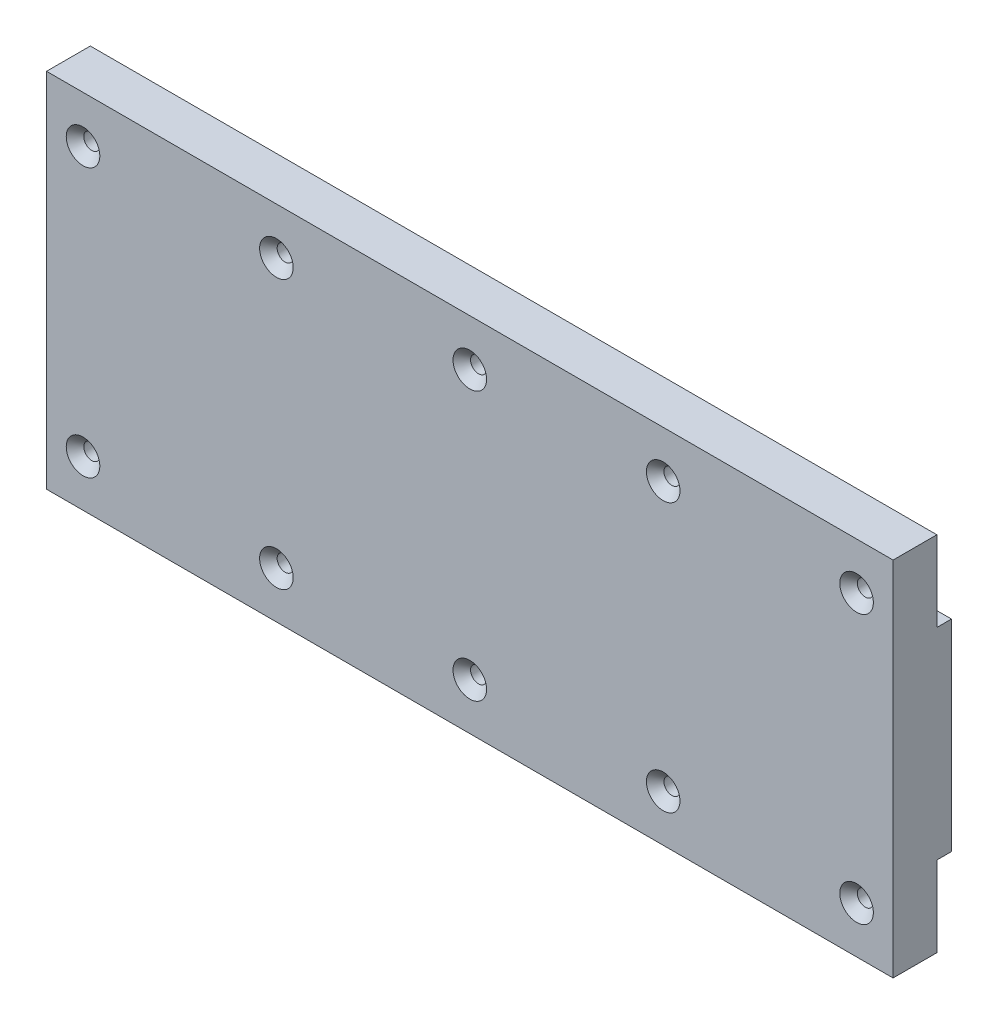
ISO-10303-21;
HEADER;
FILE_DESCRIPTION(('STEP AP214'),'2;1');
FILE_NAME('part.step','',(''),(''),'','','');
FILE_SCHEMA(('AUTOMOTIVE_DESIGN { 1 0 10303 214 1 1 1 1 }'));
ENDSEC;
DATA;
#1=APPLICATION_CONTEXT('core data for automotive mechanical design processes');
#2=APPLICATION_PROTOCOL_DEFINITION('international standard','automotive_design',2000,#1);
#3=PRODUCT_CONTEXT('',#1,'mechanical');
#4=PRODUCT('Part','Part','',(#3));
#5=PRODUCT_RELATED_PRODUCT_CATEGORY('part','',(#4));
#6=PRODUCT_DEFINITION_FORMATION('','',#4);
#7=PRODUCT_DEFINITION_CONTEXT('part definition',#1,'design');
#8=PRODUCT_DEFINITION('design','',#6,#7);
#9=PRODUCT_DEFINITION_SHAPE('','',#8);
#10=(LENGTH_UNIT() NAMED_UNIT(*) SI_UNIT(.MILLI.,.METRE.));
#11=(NAMED_UNIT(*) PLANE_ANGLE_UNIT() SI_UNIT($,.RADIAN.));
#12=(NAMED_UNIT(*) SI_UNIT($,.STERADIAN.) SOLID_ANGLE_UNIT());
#13=UNCERTAINTY_MEASURE_WITH_UNIT(LENGTH_MEASURE(1.E-05),#10,'distance_accuracy_value','');
#14=(GEOMETRIC_REPRESENTATION_CONTEXT(3) GLOBAL_UNCERTAINTY_ASSIGNED_CONTEXT((#13)) GLOBAL_UNIT_ASSIGNED_CONTEXT((#10,
#11,#12)) REPRESENTATION_CONTEXT('',''));
#15=CARTESIAN_POINT('',(0.,0.,0.));
#16=DIRECTION('',(0.,0.,1.));
#17=DIRECTION('',(1.,0.,0.));
#18=AXIS2_PLACEMENT_3D('',#15,#16,#17);
#19=CARTESIAN_POINT('',(580.,0.,0.));
#20=DIRECTION('',(0.,1.,0.));
#21=DIRECTION('',(0.,0.,1.));
#22=AXIS2_PLACEMENT_3D('',#19,#20,#21);
#23=PLANE('',#22);
#24=DIRECTION('',(0.,0.,-1.));
#25=VECTOR('',#24,1.);
#26=CARTESIAN_POINT('',(0.,0.,0.));
#27=LINE('',#26,#25);
#28=CARTESIAN_POINT('',(0.,0.,0.));
#29=VERTEX_POINT('',#28);
#30=CARTESIAN_POINT('',(0.,0.,-30.));
#31=VERTEX_POINT('',#30);
#32=EDGE_CURVE('E147',#29,#31,#27,.T.);
#33=ORIENTED_EDGE('',*,*,#32,.T.);
#34=DIRECTION('',(-1.,0.,0.));
#35=VECTOR('',#34,1.);
#36=CARTESIAN_POINT('',(580.,0.,-30.));
#37=LINE('',#36,#35);
#38=CARTESIAN_POINT('',(580.,0.,-30.));
#39=VERTEX_POINT('',#38);
#40=EDGE_CURVE('E189',#39,#31,#37,.T.);
#41=ORIENTED_EDGE('',*,*,#40,.F.);
#42=DIRECTION('',(0.,0.,-1.));
#43=VECTOR('',#42,1.);
#44=CARTESIAN_POINT('',(580.,0.,0.));
#45=LINE('',#44,#43);
#46=CARTESIAN_POINT('',(580.,0.,0.));
#47=VERTEX_POINT('',#46);
#48=EDGE_CURVE('E170',#47,#39,#45,.T.);
#49=ORIENTED_EDGE('',*,*,#48,.F.);
#50=DIRECTION('',(-1.,0.,0.));
#51=VECTOR('',#50,1.);
#52=CARTESIAN_POINT('',(580.,0.,0.));
#53=LINE('',#52,#51);
#54=EDGE_CURVE('E143',#47,#29,#53,.T.);
#55=ORIENTED_EDGE('',*,*,#54,.T.);
#56=EDGE_LOOP('',(#33,#41,#49,#55));
#57=FACE_BOUND('',#56,.T.);
#58=ADVANCED_FACE('F43',(#57),#23,.F.);
#59=CARTESIAN_POINT('',(580.,0.,-30.));
#60=DIRECTION('',(0.,0.,1.));
#61=DIRECTION('',(1.,0.,0.));
#62=AXIS2_PLACEMENT_3D('',#59,#60,#61);
#63=PLANE('',#62);
#64=CARTESIAN_POINT('',(290.,32.,-30.));
#65=DIRECTION('',(0.,0.,1.));
#66=DIRECTION('',(1.,0.,0.));
#67=AXIS2_PLACEMENT_3D('',#64,#65,#66);
#68=CIRCLE('',#67,5.49999999999996);
#69=CARTESIAN_POINT('',(295.5,32.,-30.));
#70=VERTEX_POINT('',#69);
#71=EDGE_CURVE('E152',#70,#70,#68,.T.);
#72=ORIENTED_EDGE('',*,*,#71,.T.);
#73=EDGE_LOOP('',(#72));
#74=FACE_BOUND('',#73,.T.);
#75=CARTESIAN_POINT('',(422.5,32.,-30.));
#76=DIRECTION('',(0.,0.,1.));
#77=DIRECTION('',(1.,0.,0.));
#78=AXIS2_PLACEMENT_3D('',#75,#76,#77);
#79=CIRCLE('',#78,5.49999999999996);
#80=CARTESIAN_POINT('',(428.,32.,-30.));
#81=VERTEX_POINT('',#80);
#82=EDGE_CURVE('E383',#81,#81,#79,.T.);
#83=ORIENTED_EDGE('',*,*,#82,.T.);
#84=EDGE_LOOP('',(#83));
#85=FACE_BOUND('',#84,.T.);
#86=CARTESIAN_POINT('',(25.,32.,-30.));
#87=DIRECTION('',(0.,0.,1.));
#88=DIRECTION('',(1.,0.,0.));
#89=AXIS2_PLACEMENT_3D('',#86,#87,#88);
#90=CIRCLE('',#89,5.5);
#91=CARTESIAN_POINT('',(30.5,32.,-30.));
#92=VERTEX_POINT('',#91);
#93=EDGE_CURVE('E367',#92,#92,#90,.T.);
#94=ORIENTED_EDGE('',*,*,#93,.T.);
#95=EDGE_LOOP('',(#94));
#96=FACE_BOUND('',#95,.T.);
#97=CARTESIAN_POINT('',(157.5,32.,-30.));
#98=DIRECTION('',(0.,0.,1.));
#99=DIRECTION('',(1.,0.,0.));
#100=AXIS2_PLACEMENT_3D('',#97,#98,#99);
#101=CIRCLE('',#100,5.49999999999999);
#102=CARTESIAN_POINT('',(163.,32.,-30.));
#103=VERTEX_POINT('',#102);
#104=EDGE_CURVE('E368',#103,#103,#101,.T.);
#105=ORIENTED_EDGE('',*,*,#104,.T.);
#106=EDGE_LOOP('',(#105));
#107=FACE_BOUND('',#106,.T.);
#108=CARTESIAN_POINT('',(555.,32.,-30.));
#109=DIRECTION('',(0.,0.,1.));
#110=DIRECTION('',(1.,0.,0.));
#111=AXIS2_PLACEMENT_3D('',#108,#109,#110);
#112=CIRCLE('',#111,5.49999999999996);
#113=CARTESIAN_POINT('',(560.5,32.,-30.));
#114=VERTEX_POINT('',#113);
#115=EDGE_CURVE('E655',#114,#114,#112,.T.);
#116=ORIENTED_EDGE('',*,*,#115,.T.);
#117=EDGE_LOOP('',(#116));
#118=FACE_BOUND('',#117,.T.);
#119=DIRECTION('',(0.,1.,0.));
#120=VECTOR('',#119,1.);
#121=CARTESIAN_POINT('',(0.,0.,-30.));
#122=LINE('',#121,#120);
#123=CARTESIAN_POINT('',(0.,55.,-30.));
#124=VERTEX_POINT('',#123);
#125=EDGE_CURVE('E151',#31,#124,#122,.T.);
#126=ORIENTED_EDGE('',*,*,#125,.T.);
#127=DIRECTION('',(-1.,0.,0.));
#128=VECTOR('',#127,1.);
#129=CARTESIAN_POINT('',(580.,55.,-30.));
#130=LINE('',#129,#128);
#131=CARTESIAN_POINT('',(580.,55.,-30.));
#132=VERTEX_POINT('',#131);
#133=EDGE_CURVE('E185',#132,#124,#130,.T.);
#134=ORIENTED_EDGE('',*,*,#133,.F.);
#135=DIRECTION('',(0.,1.,0.));
#136=VECTOR('',#135,1.);
#137=CARTESIAN_POINT('',(580.,0.,-30.));
#138=LINE('',#137,#136);
#139=EDGE_CURVE('E106',#39,#132,#138,.T.);
#140=ORIENTED_EDGE('',*,*,#139,.F.);
#141=ORIENTED_EDGE('',*,*,#40,.T.);
#142=EDGE_LOOP('',(#126,#134,#140,#141));
#143=FACE_BOUND('',#142,.T.);
#144=ADVANCED_FACE('F285',(#74,#85,#96,#107,#118,#143),#63,.F.);
#145=CARTESIAN_POINT('',(580.,55.,-30.));
#146=DIRECTION('',(0.,1.,0.));
#147=DIRECTION('',(0.,0.,1.));
#148=AXIS2_PLACEMENT_3D('',#145,#146,#147);
#149=PLANE('',#148);
#150=DIRECTION('',(0.,0.,-1.));
#151=VECTOR('',#150,1.);
#152=CARTESIAN_POINT('',(0.,55.,-30.));
#153=LINE('',#152,#151);
#154=CARTESIAN_POINT('',(0.,55.,-40.));
#155=VERTEX_POINT('',#154);
#156=EDGE_CURVE('E155',#124,#155,#153,.T.);
#157=ORIENTED_EDGE('',*,*,#156,.T.);
#158=DIRECTION('',(-1.,0.,0.));
#159=VECTOR('',#158,1.);
#160=CARTESIAN_POINT('',(580.,55.,-40.));
#161=LINE('',#160,#159);
#162=CARTESIAN_POINT('',(580.,55.,-40.));
#163=VERTEX_POINT('',#162);
#164=EDGE_CURVE('E181',#163,#155,#161,.T.);
#165=ORIENTED_EDGE('',*,*,#164,.F.);
#166=DIRECTION('',(0.,0.,-1.));
#167=VECTOR('',#166,1.);
#168=CARTESIAN_POINT('',(580.,55.,-30.));
#169=LINE('',#168,#167);
#170=EDGE_CURVE('E398',#132,#163,#169,.T.);
#171=ORIENTED_EDGE('',*,*,#170,.F.);
#172=ORIENTED_EDGE('',*,*,#133,.T.);
#173=EDGE_LOOP('',(#157,#165,#171,#172));
#174=FACE_BOUND('',#173,.T.);
#175=ADVANCED_FACE('F291',(#174),#149,.F.);
#176=CARTESIAN_POINT('',(580.,193.,-40.));
#177=DIRECTION('',(0.,0.,1.));
#178=DIRECTION('',(0.,-1.,0.));
#179=AXIS2_PLACEMENT_3D('',#176,#177,#178);
#180=PLANE('',#179);
#181=DIRECTION('',(0.,1.,0.));
#182=VECTOR('',#181,1.);
#183=CARTESIAN_POINT('',(0.,193.,-40.));
#184=LINE('',#183,#182);
#185=CARTESIAN_POINT('',(0.,193.,-40.));
#186=VERTEX_POINT('',#185);
#187=EDGE_CURVE('E158',#155,#186,#184,.T.);
#188=ORIENTED_EDGE('',*,*,#187,.T.);
#189=DIRECTION('',(-1.,0.,0.));
#190=VECTOR('',#189,1.);
#191=CARTESIAN_POINT('',(580.,193.,-40.));
#192=LINE('',#191,#190);
#193=CARTESIAN_POINT('',(580.,193.,-40.));
#194=VERTEX_POINT('',#193);
#195=EDGE_CURVE('E177',#194,#186,#192,.T.);
#196=ORIENTED_EDGE('',*,*,#195,.F.);
#197=DIRECTION('',(0.,1.,0.));
#198=VECTOR('',#197,1.);
#199=CARTESIAN_POINT('',(580.,193.,-40.));
#200=LINE('',#199,#198);
#201=EDGE_CURVE('E401',#163,#194,#200,.T.);
#202=ORIENTED_EDGE('',*,*,#201,.F.);
#203=ORIENTED_EDGE('',*,*,#164,.T.);
#204=EDGE_LOOP('',(#188,#196,#202,#203));
#205=FACE_BOUND('',#204,.T.);
#206=ADVANCED_FACE('F409',(#205),#180,.F.);
#207=CARTESIAN_POINT('',(580.,193.,-30.));
#208=DIRECTION('',(0.,-1.,0.));
#209=DIRECTION('',(0.,0.,-1.));
#210=AXIS2_PLACEMENT_3D('',#207,#208,#209);
#211=PLANE('',#210);
#212=DIRECTION('',(0.,0.,1.));
#213=VECTOR('',#212,1.);
#214=CARTESIAN_POINT('',(0.,193.,-30.));
#215=LINE('',#214,#213);
#216=CARTESIAN_POINT('',(0.,193.,-30.));
#217=VERTEX_POINT('',#216);
#218=EDGE_CURVE('E161',#186,#217,#215,.T.);
#219=ORIENTED_EDGE('',*,*,#218,.T.);
#220=DIRECTION('',(-1.,0.,0.));
#221=VECTOR('',#220,1.);
#222=CARTESIAN_POINT('',(580.,193.,-30.));
#223=LINE('',#222,#221);
#224=CARTESIAN_POINT('',(580.,193.,-30.));
#225=VERTEX_POINT('',#224);
#226=EDGE_CURVE('E136',#225,#217,#223,.T.);
#227=ORIENTED_EDGE('',*,*,#226,.F.);
#228=DIRECTION('',(0.,0.,1.));
#229=VECTOR('',#228,1.);
#230=CARTESIAN_POINT('',(580.,193.,-30.));
#231=LINE('',#230,#229);
#232=EDGE_CURVE('E125',#194,#225,#231,.T.);
#233=ORIENTED_EDGE('',*,*,#232,.F.);
#234=ORIENTED_EDGE('',*,*,#195,.T.);
#235=EDGE_LOOP('',(#219,#227,#233,#234));
#236=FACE_BOUND('',#235,.T.);
#237=ADVANCED_FACE('F413',(#236),#211,.F.);
#238=CARTESIAN_POINT('',(580.,248.,-30.));
#239=DIRECTION('',(0.,0.,1.));
#240=DIRECTION('',(1.,0.,0.));
#241=AXIS2_PLACEMENT_3D('',#238,#239,#240);
#242=PLANE('',#241);
#243=CARTESIAN_POINT('',(422.5,216.,-30.));
#244=DIRECTION('',(0.,0.,1.));
#245=DIRECTION('',(1.,0.,0.));
#246=AXIS2_PLACEMENT_3D('',#243,#244,#245);
#247=CIRCLE('',#246,5.50000000000002);
#248=CARTESIAN_POINT('',(428.,216.,-30.));
#249=VERTEX_POINT('',#248);
#250=EDGE_CURVE('E387',#249,#249,#247,.T.);
#251=ORIENTED_EDGE('',*,*,#250,.T.);
#252=EDGE_LOOP('',(#251));
#253=FACE_BOUND('',#252,.T.);
#254=CARTESIAN_POINT('',(555.,216.,-30.));
#255=DIRECTION('',(0.,0.,1.));
#256=DIRECTION('',(1.,0.,0.));
#257=AXIS2_PLACEMENT_3D('',#254,#255,#256);
#258=CIRCLE('',#257,5.49999999999996);
#259=CARTESIAN_POINT('',(560.5,216.,-30.));
#260=VERTEX_POINT('',#259);
#261=EDGE_CURVE('E373',#260,#260,#258,.T.);
#262=ORIENTED_EDGE('',*,*,#261,.T.);
#263=EDGE_LOOP('',(#262));
#264=FACE_BOUND('',#263,.T.);
#265=CARTESIAN_POINT('',(157.5,216.,-30.));
#266=DIRECTION('',(0.,0.,1.));
#267=DIRECTION('',(1.,0.,0.));
#268=AXIS2_PLACEMENT_3D('',#265,#266,#267);
#269=CIRCLE('',#268,5.49999999999999);
#270=CARTESIAN_POINT('',(163.,216.,-30.));
#271=VERTEX_POINT('',#270);
#272=EDGE_CURVE('E364',#271,#271,#269,.T.);
#273=ORIENTED_EDGE('',*,*,#272,.T.);
#274=EDGE_LOOP('',(#273));
#275=FACE_BOUND('',#274,.T.);
#276=CARTESIAN_POINT('',(290.,216.,-30.));
#277=DIRECTION('',(0.,0.,1.));
#278=DIRECTION('',(1.,0.,0.));
#279=AXIS2_PLACEMENT_3D('',#276,#277,#278);
#280=CIRCLE('',#279,5.49999999999996);
#281=CARTESIAN_POINT('',(295.5,216.,-30.));
#282=VERTEX_POINT('',#281);
#283=EDGE_CURVE('E376',#282,#282,#280,.T.);
#284=ORIENTED_EDGE('',*,*,#283,.T.);
#285=EDGE_LOOP('',(#284));
#286=FACE_BOUND('',#285,.T.);
#287=CARTESIAN_POINT('',(24.9999999999999,216.,-30.));
#288=DIRECTION('',(0.,0.,1.));
#289=DIRECTION('',(1.,0.,0.));
#290=AXIS2_PLACEMENT_3D('',#287,#288,#289);
#291=CIRCLE('',#290,5.5);
#292=CARTESIAN_POINT('',(30.4999999999999,216.,-30.));
#293=VERTEX_POINT('',#292);
#294=EDGE_CURVE('E658',#293,#293,#291,.T.);
#295=ORIENTED_EDGE('',*,*,#294,.T.);
#296=EDGE_LOOP('',(#295));
#297=FACE_BOUND('',#296,.T.);
#298=DIRECTION('',(0.,1.,0.));
#299=VECTOR('',#298,1.);
#300=CARTESIAN_POINT('',(0.,248.,-30.));
#301=LINE('',#300,#299);
#302=CARTESIAN_POINT('',(0.,248.,-30.));
#303=VERTEX_POINT('',#302);
#304=EDGE_CURVE('E134',#217,#303,#301,.T.);
#305=ORIENTED_EDGE('',*,*,#304,.T.);
#306=DIRECTION('',(-1.,0.,0.));
#307=VECTOR('',#306,1.);
#308=CARTESIAN_POINT('',(580.,248.,-30.));
#309=LINE('',#308,#307);
#310=CARTESIAN_POINT('',(580.,248.,-30.));
#311=VERTEX_POINT('',#310);
#312=EDGE_CURVE('E131',#311,#303,#309,.T.);
#313=ORIENTED_EDGE('',*,*,#312,.F.);
#314=DIRECTION('',(0.,1.,0.));
#315=VECTOR('',#314,1.);
#316=CARTESIAN_POINT('',(580.,248.,-30.));
#317=LINE('',#316,#315);
#318=EDGE_CURVE('E119',#225,#311,#317,.T.);
#319=ORIENTED_EDGE('',*,*,#318,.F.);
#320=ORIENTED_EDGE('',*,*,#226,.T.);
#321=EDGE_LOOP('',(#305,#313,#319,#320));
#322=FACE_BOUND('',#321,.T.);
#323=ADVANCED_FACE('F132',(#253,#264,#275,#286,#297,#322),#242,.F.);
#324=CARTESIAN_POINT('',(580.,248.,0.));
#325=DIRECTION('',(0.,-1.,0.));
#326=DIRECTION('',(0.,0.,-1.));
#327=AXIS2_PLACEMENT_3D('',#324,#325,#326);
#328=PLANE('',#327);
#329=DIRECTION('',(0.,0.,1.));
#330=VECTOR('',#329,1.);
#331=CARTESIAN_POINT('',(0.,248.,0.));
#332=LINE('',#331,#330);
#333=CARTESIAN_POINT('',(0.,248.,0.));
#334=VERTEX_POINT('',#333);
#335=EDGE_CURVE('E91',#303,#334,#332,.T.);
#336=ORIENTED_EDGE('',*,*,#335,.T.);
#337=DIRECTION('',(-1.,0.,0.));
#338=VECTOR('',#337,1.);
#339=CARTESIAN_POINT('',(580.,248.,0.));
#340=LINE('',#339,#338);
#341=CARTESIAN_POINT('',(580.,248.,0.));
#342=VERTEX_POINT('',#341);
#343=EDGE_CURVE('E137',#342,#334,#340,.T.);
#344=ORIENTED_EDGE('',*,*,#343,.F.);
#345=DIRECTION('',(0.,0.,1.));
#346=VECTOR('',#345,1.);
#347=CARTESIAN_POINT('',(580.,248.,0.));
#348=LINE('',#347,#346);
#349=EDGE_CURVE('E123',#311,#342,#348,.T.);
#350=ORIENTED_EDGE('',*,*,#349,.F.);
#351=ORIENTED_EDGE('',*,*,#312,.T.);
#352=EDGE_LOOP('',(#336,#344,#350,#351));
#353=FACE_BOUND('',#352,.T.);
#354=ADVANCED_FACE('F139',(#353),#328,.F.);
#355=CARTESIAN_POINT('',(580.,0.,0.));
#356=DIRECTION('',(0.,0.,-1.));
#357=DIRECTION('',(-1.,0.,0.));
#358=AXIS2_PLACEMENT_3D('',#355,#356,#357);
#359=PLANE('',#358);
#360=CARTESIAN_POINT('',(555.,32.,0.));
#361=DIRECTION('',(0.,0.,-1.));
#362=DIRECTION('',(-1.,0.,0.));
#363=AXIS2_PLACEMENT_3D('',#360,#361,#362);
#364=CIRCLE('',#363,11.5000000000001);
#365=CARTESIAN_POINT('',(543.5,32.,0.));
#366=VERTEX_POINT('',#365);
#367=EDGE_CURVE('E232',#366,#366,#364,.T.);
#368=ORIENTED_EDGE('',*,*,#367,.T.);
#369=EDGE_LOOP('',(#368));
#370=FACE_BOUND('',#369,.T.);
#371=CARTESIAN_POINT('',(555.,216.,0.));
#372=DIRECTION('',(0.,0.,-1.));
#373=DIRECTION('',(-1.,0.,0.));
#374=AXIS2_PLACEMENT_3D('',#371,#372,#373);
#375=CIRCLE('',#374,11.5000000000001);
#376=CARTESIAN_POINT('',(543.5,216.,0.));
#377=VERTEX_POINT('',#376);
#378=EDGE_CURVE('E228',#377,#377,#375,.T.);
#379=ORIENTED_EDGE('',*,*,#378,.T.);
#380=EDGE_LOOP('',(#379));
#381=FACE_BOUND('',#380,.T.);
#382=CARTESIAN_POINT('',(422.5,216.,0.));
#383=DIRECTION('',(0.,0.,-1.));
#384=DIRECTION('',(-1.,0.,0.));
#385=AXIS2_PLACEMENT_3D('',#382,#383,#384);
#386=CIRCLE('',#385,11.5000000000002);
#387=CARTESIAN_POINT('',(411.,216.,0.));
#388=VERTEX_POINT('',#387);
#389=EDGE_CURVE('E224',#388,#388,#386,.T.);
#390=ORIENTED_EDGE('',*,*,#389,.T.);
#391=EDGE_LOOP('',(#390));
#392=FACE_BOUND('',#391,.T.);
#393=CARTESIAN_POINT('',(422.5,32.,0.));
#394=DIRECTION('',(0.,0.,-1.));
#395=DIRECTION('',(-1.,0.,0.));
#396=AXIS2_PLACEMENT_3D('',#393,#394,#395);
#397=CIRCLE('',#396,11.5000000000001);
#398=CARTESIAN_POINT('',(411.,32.,0.));
#399=VERTEX_POINT('',#398);
#400=EDGE_CURVE('E220',#399,#399,#397,.T.);
#401=ORIENTED_EDGE('',*,*,#400,.T.);
#402=EDGE_LOOP('',(#401));
#403=FACE_BOUND('',#402,.T.);
#404=CARTESIAN_POINT('',(290.,32.,0.));
#405=DIRECTION('',(0.,0.,-1.));
#406=DIRECTION('',(-1.,0.,0.));
#407=AXIS2_PLACEMENT_3D('',#404,#405,#406);
#408=CIRCLE('',#407,11.5000000000001);
#409=CARTESIAN_POINT('',(278.5,32.,0.));
#410=VERTEX_POINT('',#409);
#411=EDGE_CURVE('E216',#410,#410,#408,.T.);
#412=ORIENTED_EDGE('',*,*,#411,.T.);
#413=EDGE_LOOP('',(#412));
#414=FACE_BOUND('',#413,.T.);
#415=CARTESIAN_POINT('',(290.,216.,0.));
#416=DIRECTION('',(0.,0.,-1.));
#417=DIRECTION('',(-1.,0.,0.));
#418=AXIS2_PLACEMENT_3D('',#415,#416,#417);
#419=CIRCLE('',#418,11.5000000000001);
#420=CARTESIAN_POINT('',(278.5,216.,0.));
#421=VERTEX_POINT('',#420);
#422=EDGE_CURVE('E212',#421,#421,#419,.T.);
#423=ORIENTED_EDGE('',*,*,#422,.T.);
#424=EDGE_LOOP('',(#423));
#425=FACE_BOUND('',#424,.T.);
#426=CARTESIAN_POINT('',(157.5,216.,0.));
#427=DIRECTION('',(0.,0.,-1.));
#428=DIRECTION('',(-1.,0.,0.));
#429=AXIS2_PLACEMENT_3D('',#426,#427,#428);
#430=CIRCLE('',#429,11.5000000000001);
#431=CARTESIAN_POINT('',(146.,216.,0.));
#432=VERTEX_POINT('',#431);
#433=EDGE_CURVE('E208',#432,#432,#430,.T.);
#434=ORIENTED_EDGE('',*,*,#433,.T.);
#435=EDGE_LOOP('',(#434));
#436=FACE_BOUND('',#435,.T.);
#437=CARTESIAN_POINT('',(157.5,32.,0.));
#438=DIRECTION('',(0.,0.,-1.));
#439=DIRECTION('',(-1.,0.,0.));
#440=AXIS2_PLACEMENT_3D('',#437,#438,#439);
#441=CIRCLE('',#440,11.5000000000001);
#442=CARTESIAN_POINT('',(146.,32.,0.));
#443=VERTEX_POINT('',#442);
#444=EDGE_CURVE('E204',#443,#443,#441,.T.);
#445=ORIENTED_EDGE('',*,*,#444,.T.);
#446=EDGE_LOOP('',(#445));
#447=FACE_BOUND('',#446,.T.);
#448=CARTESIAN_POINT('',(25.,32.,0.));
#449=DIRECTION('',(0.,0.,-1.));
#450=DIRECTION('',(-1.,0.,0.));
#451=AXIS2_PLACEMENT_3D('',#448,#449,#450);
#452=CIRCLE('',#451,11.5000000000001);
#453=CARTESIAN_POINT('',(13.4999999999999,32.,0.));
#454=VERTEX_POINT('',#453);
#455=EDGE_CURVE('E200',#454,#454,#452,.T.);
#456=ORIENTED_EDGE('',*,*,#455,.T.);
#457=EDGE_LOOP('',(#456));
#458=FACE_BOUND('',#457,.T.);
#459=CARTESIAN_POINT('',(24.9999999999999,216.,0.));
#460=DIRECTION('',(0.,0.,-1.));
#461=DIRECTION('',(-1.,0.,0.));
#462=AXIS2_PLACEMENT_3D('',#459,#460,#461);
#463=CIRCLE('',#462,11.5000000000001);
#464=CARTESIAN_POINT('',(13.4999999999998,216.,0.));
#465=VERTEX_POINT('',#464);
#466=EDGE_CURVE('E196',#465,#465,#463,.T.);
#467=ORIENTED_EDGE('',*,*,#466,.T.);
#468=EDGE_LOOP('',(#467));
#469=FACE_BOUND('',#468,.T.);
#470=DIRECTION('',(0.,-1.,0.));
#471=VECTOR('',#470,1.);
#472=CARTESIAN_POINT('',(0.,0.,0.));
#473=LINE('',#472,#471);
#474=EDGE_CURVE('E97',#334,#29,#473,.T.);
#475=ORIENTED_EDGE('',*,*,#474,.T.);
#476=ORIENTED_EDGE('',*,*,#54,.F.);
#477=DIRECTION('',(0.,-1.,0.));
#478=VECTOR('',#477,1.);
#479=CARTESIAN_POINT('',(580.,0.,0.));
#480=LINE('',#479,#478);
#481=EDGE_CURVE('E62',#342,#47,#480,.T.);
#482=ORIENTED_EDGE('',*,*,#481,.F.);
#483=ORIENTED_EDGE('',*,*,#343,.T.);
#484=EDGE_LOOP('',(#475,#476,#482,#483));
#485=FACE_BOUND('',#484,.T.);
#486=ADVANCED_FACE('F420',(#370,#381,#392,#403,#414,#425,#436,#447,#458,#469,#485),#359,.F.);
#487=CARTESIAN_POINT('',(580.,0.,0.));
#488=DIRECTION('',(1.,0.,0.));
#489=DIRECTION('',(0.,0.,-1.));
#490=AXIS2_PLACEMENT_3D('',#487,#488,#489);
#491=PLANE('',#490);
#492=ORIENTED_EDGE('',*,*,#48,.T.);
#493=ORIENTED_EDGE('',*,*,#139,.T.);
#494=ORIENTED_EDGE('',*,*,#170,.T.);
#495=ORIENTED_EDGE('',*,*,#201,.T.);
#496=ORIENTED_EDGE('',*,*,#232,.T.);
#497=ORIENTED_EDGE('',*,*,#318,.T.);
#498=ORIENTED_EDGE('',*,*,#349,.T.);
#499=ORIENTED_EDGE('',*,*,#481,.T.);
#500=EDGE_LOOP('',(#492,#493,#494,#495,#496,#497,#498,#499));
#501=FACE_BOUND('',#500,.T.);
#502=ADVANCED_FACE('F121',(#501),#491,.T.);
#503=CARTESIAN_POINT('',(0.,0.,0.));
#504=DIRECTION('',(1.,0.,0.));
#505=DIRECTION('',(0.,0.,-1.));
#506=AXIS2_PLACEMENT_3D('',#503,#504,#505);
#507=PLANE('',#506);
#508=ORIENTED_EDGE('',*,*,#32,.F.);
#509=ORIENTED_EDGE('',*,*,#474,.F.);
#510=ORIENTED_EDGE('',*,*,#335,.F.);
#511=ORIENTED_EDGE('',*,*,#304,.F.);
#512=ORIENTED_EDGE('',*,*,#218,.F.);
#513=ORIENTED_EDGE('',*,*,#187,.F.);
#514=ORIENTED_EDGE('',*,*,#156,.F.);
#515=ORIENTED_EDGE('',*,*,#125,.F.);
#516=EDGE_LOOP('',(#508,#509,#510,#511,#512,#513,#514,#515));
#517=FACE_BOUND('',#516,.T.);
#518=ADVANCED_FACE('F416',(#517),#507,.F.);
#519=CARTESIAN_POINT('',(24.9999999999999,216.,-580.));
#520=DIRECTION('',(0.,0.,1.));
#521=DIRECTION('',(1.,0.,0.));
#522=AXIS2_PLACEMENT_3D('',#519,#520,#521);
#523=CYLINDRICAL_SURFACE('',#522,5.5);
#524=CARTESIAN_POINT('',(24.9999999999999,216.,-6.00000000000001));
#525=DIRECTION('',(0.,0.,-1.));
#526=DIRECTION('',(-1.,0.,0.));
#527=AXIS2_PLACEMENT_3D('',#524,#525,#526);
#528=CIRCLE('',#527,5.5);
#529=CARTESIAN_POINT('',(19.4999999999999,216.,-6.00000000000001));
#530=VERTEX_POINT('',#529);
#531=EDGE_CURVE('E11',#530,#530,#528,.F.);
#532=ORIENTED_EDGE('',*,*,#531,.T.);
#533=EDGE_LOOP('',(#532));
#534=FACE_BOUND('',#533,.T.);
#535=ORIENTED_EDGE('',*,*,#294,.F.);
#536=EDGE_LOOP('',(#535));
#537=FACE_BOUND('',#536,.T.);
#538=ADVANCED_FACE('F476',(#534,#537),#523,.F.);
#539=CARTESIAN_POINT('',(555.,32.,-580.));
#540=DIRECTION('',(0.,0.,1.));
#541=DIRECTION('',(1.,0.,0.));
#542=AXIS2_PLACEMENT_3D('',#539,#540,#541);
#543=CYLINDRICAL_SURFACE('',#542,5.49999999999996);
#544=CARTESIAN_POINT('',(555.,32.,-6.00000000000012));
#545=DIRECTION('',(0.,0.,-1.));
#546=DIRECTION('',(-1.,0.,0.));
#547=AXIS2_PLACEMENT_3D('',#544,#545,#546);
#548=CIRCLE('',#547,5.49999999999996);
#549=CARTESIAN_POINT('',(549.5,32.,-6.00000000000012));
#550=VERTEX_POINT('',#549);
#551=EDGE_CURVE('E192',#550,#550,#548,.F.);
#552=ORIENTED_EDGE('',*,*,#551,.T.);
#553=EDGE_LOOP('',(#552));
#554=FACE_BOUND('',#553,.T.);
#555=ORIENTED_EDGE('',*,*,#115,.F.);
#556=EDGE_LOOP('',(#555));
#557=FACE_BOUND('',#556,.T.);
#558=ADVANCED_FACE('F501',(#554,#557),#543,.F.);
#559=CARTESIAN_POINT('',(290.,216.,-580.));
#560=DIRECTION('',(0.,0.,1.));
#561=DIRECTION('',(1.,0.,0.));
#562=AXIS2_PLACEMENT_3D('',#559,#560,#561);
#563=CYLINDRICAL_SURFACE('',#562,5.49999999999996);
#564=CARTESIAN_POINT('',(290.,216.,-6.00000000000012));
#565=DIRECTION('',(0.,0.,-1.));
#566=DIRECTION('',(-1.,0.,0.));
#567=AXIS2_PLACEMENT_3D('',#564,#565,#566);
#568=CIRCLE('',#567,5.49999999999996);
#569=CARTESIAN_POINT('',(284.5,216.,-6.00000000000012));
#570=VERTEX_POINT('',#569);
#571=EDGE_CURVE('E252',#570,#570,#568,.F.);
#572=ORIENTED_EDGE('',*,*,#571,.T.);
#573=EDGE_LOOP('',(#572));
#574=FACE_BOUND('',#573,.T.);
#575=ORIENTED_EDGE('',*,*,#283,.F.);
#576=EDGE_LOOP('',(#575));
#577=FACE_BOUND('',#576,.T.);
#578=ADVANCED_FACE('F508',(#574,#577),#563,.F.);
#579=CARTESIAN_POINT('',(157.5,32.,-580.));
#580=DIRECTION('',(0.,0.,1.));
#581=DIRECTION('',(1.,0.,0.));
#582=AXIS2_PLACEMENT_3D('',#579,#580,#581);
#583=CYLINDRICAL_SURFACE('',#582,5.49999999999999);
#584=CARTESIAN_POINT('',(157.5,32.,-6.00000000000001));
#585=DIRECTION('',(0.,0.,-1.));
#586=DIRECTION('',(-1.,0.,0.));
#587=AXIS2_PLACEMENT_3D('',#584,#585,#586);
#588=CIRCLE('',#587,5.49999999999999);
#589=CARTESIAN_POINT('',(152.,32.,-6.00000000000001));
#590=VERTEX_POINT('',#589);
#591=EDGE_CURVE('E260',#590,#590,#588,.F.);
#592=ORIENTED_EDGE('',*,*,#591,.T.);
#593=EDGE_LOOP('',(#592));
#594=FACE_BOUND('',#593,.T.);
#595=ORIENTED_EDGE('',*,*,#104,.F.);
#596=EDGE_LOOP('',(#595));
#597=FACE_BOUND('',#596,.T.);
#598=ADVANCED_FACE('F360',(#594,#597),#583,.F.);
#599=CARTESIAN_POINT('',(157.5,216.,-580.));
#600=DIRECTION('',(0.,0.,1.));
#601=DIRECTION('',(1.,0.,0.));
#602=AXIS2_PLACEMENT_3D('',#599,#600,#601);
#603=CYLINDRICAL_SURFACE('',#602,5.49999999999999);
#604=CARTESIAN_POINT('',(157.5,216.,-6.00000000000001));
#605=DIRECTION('',(0.,0.,-1.));
#606=DIRECTION('',(-1.,0.,0.));
#607=AXIS2_PLACEMENT_3D('',#604,#605,#606);
#608=CIRCLE('',#607,5.49999999999999);
#609=CARTESIAN_POINT('',(152.,216.,-6.00000000000001));
#610=VERTEX_POINT('',#609);
#611=EDGE_CURVE('E256',#610,#610,#608,.F.);
#612=ORIENTED_EDGE('',*,*,#611,.T.);
#613=EDGE_LOOP('',(#612));
#614=FACE_BOUND('',#613,.T.);
#615=ORIENTED_EDGE('',*,*,#272,.F.);
#616=EDGE_LOOP('',(#615));
#617=FACE_BOUND('',#616,.T.);
#618=ADVANCED_FACE('F357',(#614,#617),#603,.F.);
#619=CARTESIAN_POINT('',(25.,32.,-580.));
#620=DIRECTION('',(0.,0.,1.));
#621=DIRECTION('',(1.,0.,0.));
#622=AXIS2_PLACEMENT_3D('',#619,#620,#621);
#623=CYLINDRICAL_SURFACE('',#622,5.5);
#624=CARTESIAN_POINT('',(25.,32.,-6.00000000000001));
#625=DIRECTION('',(0.,0.,-1.));
#626=DIRECTION('',(-1.,0.,0.));
#627=AXIS2_PLACEMENT_3D('',#624,#625,#626);
#628=CIRCLE('',#627,5.5);
#629=CARTESIAN_POINT('',(19.5,32.,-6.00000000000001));
#630=VERTEX_POINT('',#629);
#631=EDGE_CURVE('E54',#630,#630,#628,.F.);
#632=ORIENTED_EDGE('',*,*,#631,.T.);
#633=EDGE_LOOP('',(#632));
#634=FACE_BOUND('',#633,.T.);
#635=ORIENTED_EDGE('',*,*,#93,.F.);
#636=EDGE_LOOP('',(#635));
#637=FACE_BOUND('',#636,.T.);
#638=ADVANCED_FACE('F267',(#634,#637),#623,.F.);
#639=CARTESIAN_POINT('',(555.,216.,-580.));
#640=DIRECTION('',(0.,0.,1.));
#641=DIRECTION('',(1.,0.,0.));
#642=AXIS2_PLACEMENT_3D('',#639,#640,#641);
#643=CYLINDRICAL_SURFACE('',#642,5.49999999999996);
#644=CARTESIAN_POINT('',(555.,216.,-6.00000000000012));
#645=DIRECTION('',(0.,0.,-1.));
#646=DIRECTION('',(-1.,0.,0.));
#647=AXIS2_PLACEMENT_3D('',#644,#645,#646);
#648=CIRCLE('',#647,5.49999999999996);
#649=CARTESIAN_POINT('',(549.5,216.,-6.00000000000012));
#650=VERTEX_POINT('',#649);
#651=EDGE_CURVE('E236',#650,#650,#648,.F.);
#652=ORIENTED_EDGE('',*,*,#651,.T.);
#653=EDGE_LOOP('',(#652));
#654=FACE_BOUND('',#653,.T.);
#655=ORIENTED_EDGE('',*,*,#261,.F.);
#656=EDGE_LOOP('',(#655));
#657=FACE_BOUND('',#656,.T.);
#658=ADVANCED_FACE('F534',(#654,#657),#643,.F.);
#659=CARTESIAN_POINT('',(422.5,32.,-580.));
#660=DIRECTION('',(0.,0.,1.));
#661=DIRECTION('',(1.,0.,0.));
#662=AXIS2_PLACEMENT_3D('',#659,#660,#661);
#663=CYLINDRICAL_SURFACE('',#662,5.49999999999996);
#664=CARTESIAN_POINT('',(422.5,32.,-6.00000000000012));
#665=DIRECTION('',(0.,0.,-1.));
#666=DIRECTION('',(-1.,0.,0.));
#667=AXIS2_PLACEMENT_3D('',#664,#665,#666);
#668=CIRCLE('',#667,5.49999999999996);
#669=CARTESIAN_POINT('',(417.,32.,-6.00000000000012));
#670=VERTEX_POINT('',#669);
#671=EDGE_CURVE('E244',#670,#670,#668,.F.);
#672=ORIENTED_EDGE('',*,*,#671,.T.);
#673=EDGE_LOOP('',(#672));
#674=FACE_BOUND('',#673,.T.);
#675=ORIENTED_EDGE('',*,*,#82,.F.);
#676=EDGE_LOOP('',(#675));
#677=FACE_BOUND('',#676,.T.);
#678=ADVANCED_FACE('F541',(#674,#677),#663,.F.);
#679=CARTESIAN_POINT('',(422.5,216.,-580.));
#680=DIRECTION('',(0.,0.,1.));
#681=DIRECTION('',(1.,0.,0.));
#682=AXIS2_PLACEMENT_3D('',#679,#680,#681);
#683=CYLINDRICAL_SURFACE('',#682,5.50000000000002);
#684=CARTESIAN_POINT('',(422.5,216.,-6.00000000000023));
#685=DIRECTION('',(0.,0.,-1.));
#686=DIRECTION('',(-1.,0.,0.));
#687=AXIS2_PLACEMENT_3D('',#684,#685,#686);
#688=CIRCLE('',#687,5.50000000000002);
#689=CARTESIAN_POINT('',(417.,216.,-6.00000000000023));
#690=VERTEX_POINT('',#689);
#691=EDGE_CURVE('E240',#690,#690,#688,.F.);
#692=ORIENTED_EDGE('',*,*,#691,.T.);
#693=EDGE_LOOP('',(#692));
#694=FACE_BOUND('',#693,.T.);
#695=ORIENTED_EDGE('',*,*,#250,.F.);
#696=EDGE_LOOP('',(#695));
#697=FACE_BOUND('',#696,.T.);
#698=ADVANCED_FACE('F549',(#694,#697),#683,.F.);
#699=CARTESIAN_POINT('',(290.,32.,-580.));
#700=DIRECTION('',(0.,0.,1.));
#701=DIRECTION('',(1.,0.,0.));
#702=AXIS2_PLACEMENT_3D('',#699,#700,#701);
#703=CYLINDRICAL_SURFACE('',#702,5.49999999999996);
#704=CARTESIAN_POINT('',(290.,32.,-6.00000000000012));
#705=DIRECTION('',(0.,0.,-1.));
#706=DIRECTION('',(-1.,0.,0.));
#707=AXIS2_PLACEMENT_3D('',#704,#705,#706);
#708=CIRCLE('',#707,5.49999999999996);
#709=CARTESIAN_POINT('',(284.5,32.,-6.00000000000012));
#710=VERTEX_POINT('',#709);
#711=EDGE_CURVE('E248',#710,#710,#708,.F.);
#712=ORIENTED_EDGE('',*,*,#711,.T.);
#713=EDGE_LOOP('',(#712));
#714=FACE_BOUND('',#713,.T.);
#715=ORIENTED_EDGE('',*,*,#71,.F.);
#716=EDGE_LOOP('',(#715));
#717=FACE_BOUND('',#716,.T.);
#718=ADVANCED_FACE('F304',(#714,#717),#703,.F.);
#719=CARTESIAN_POINT('',(555.,32.,-6.00000000000012));
#720=DIRECTION('',(0.,0.,1.));
#721=DIRECTION('',(1.,0.,0.));
#722=AXIS2_PLACEMENT_3D('',#719,#720,#721);
#723=CONICAL_SURFACE('',#722,5.49999999999996,0.785398163397447);
#724=ORIENTED_EDGE('',*,*,#367,.F.);
#725=EDGE_LOOP('',(#724));
#726=FACE_BOUND('',#725,.T.);
#727=ORIENTED_EDGE('',*,*,#551,.F.);
#728=EDGE_LOOP('',(#727));
#729=FACE_BOUND('',#728,.T.);
#730=ADVANCED_FACE('F297',(#726,#729),#723,.F.);
#731=CARTESIAN_POINT('',(555.,216.,-6.00000000000012));
#732=DIRECTION('',(0.,0.,1.));
#733=DIRECTION('',(1.,0.,0.));
#734=AXIS2_PLACEMENT_3D('',#731,#732,#733);
#735=CONICAL_SURFACE('',#734,5.49999999999996,0.785398163397447);
#736=ORIENTED_EDGE('',*,*,#378,.F.);
#737=EDGE_LOOP('',(#736));
#738=FACE_BOUND('',#737,.T.);
#739=ORIENTED_EDGE('',*,*,#651,.F.);
#740=EDGE_LOOP('',(#739));
#741=FACE_BOUND('',#740,.T.);
#742=ADVANCED_FACE('F303',(#738,#741),#735,.F.);
#743=CARTESIAN_POINT('',(422.5,216.,-6.00000000000023));
#744=DIRECTION('',(0.,0.,1.));
#745=DIRECTION('',(1.,0.,0.));
#746=AXIS2_PLACEMENT_3D('',#743,#744,#745);
#747=CONICAL_SURFACE('',#746,5.50000000000002,0.785398163397443);
#748=ORIENTED_EDGE('',*,*,#389,.F.);
#749=EDGE_LOOP('',(#748));
#750=FACE_BOUND('',#749,.T.);
#751=ORIENTED_EDGE('',*,*,#691,.F.);
#752=EDGE_LOOP('',(#751));
#753=FACE_BOUND('',#752,.T.);
#754=ADVANCED_FACE('F311',(#750,#753),#747,.F.);
#755=CARTESIAN_POINT('',(422.5,32.,-6.00000000000012));
#756=DIRECTION('',(0.,0.,1.));
#757=DIRECTION('',(1.,0.,0.));
#758=AXIS2_PLACEMENT_3D('',#755,#756,#757);
#759=CONICAL_SURFACE('',#758,5.49999999999996,0.785398163397447);
#760=ORIENTED_EDGE('',*,*,#400,.F.);
#761=EDGE_LOOP('',(#760));
#762=FACE_BOUND('',#761,.T.);
#763=ORIENTED_EDGE('',*,*,#671,.F.);
#764=EDGE_LOOP('',(#763));
#765=FACE_BOUND('',#764,.T.);
#766=ADVANCED_FACE('F318',(#762,#765),#759,.F.);
#767=CARTESIAN_POINT('',(290.,32.,-6.00000000000012));
#768=DIRECTION('',(0.,0.,1.));
#769=DIRECTION('',(1.,0.,0.));
#770=AXIS2_PLACEMENT_3D('',#767,#768,#769);
#771=CONICAL_SURFACE('',#770,5.49999999999996,0.785398163397447);
#772=ORIENTED_EDGE('',*,*,#411,.F.);
#773=EDGE_LOOP('',(#772));
#774=FACE_BOUND('',#773,.T.);
#775=ORIENTED_EDGE('',*,*,#711,.F.);
#776=EDGE_LOOP('',(#775));
#777=FACE_BOUND('',#776,.T.);
#778=ADVANCED_FACE('F325',(#774,#777),#771,.F.);
#779=CARTESIAN_POINT('',(290.,216.,-6.00000000000012));
#780=DIRECTION('',(0.,0.,1.));
#781=DIRECTION('',(1.,0.,0.));
#782=AXIS2_PLACEMENT_3D('',#779,#780,#781);
#783=CONICAL_SURFACE('',#782,5.49999999999996,0.785398163397447);
#784=ORIENTED_EDGE('',*,*,#422,.F.);
#785=EDGE_LOOP('',(#784));
#786=FACE_BOUND('',#785,.T.);
#787=ORIENTED_EDGE('',*,*,#571,.F.);
#788=EDGE_LOOP('',(#787));
#789=FACE_BOUND('',#788,.T.);
#790=ADVANCED_FACE('F332',(#786,#789),#783,.F.);
#791=CARTESIAN_POINT('',(157.5,216.,-6.00000000000001));
#792=DIRECTION('',(0.,0.,1.));
#793=DIRECTION('',(1.,0.,0.));
#794=AXIS2_PLACEMENT_3D('',#791,#792,#793);
#795=CONICAL_SURFACE('',#794,5.49999999999999,0.785398163397454);
#796=ORIENTED_EDGE('',*,*,#433,.F.);
#797=EDGE_LOOP('',(#796));
#798=FACE_BOUND('',#797,.T.);
#799=ORIENTED_EDGE('',*,*,#611,.F.);
#800=EDGE_LOOP('',(#799));
#801=FACE_BOUND('',#800,.T.);
#802=ADVANCED_FACE('F279',(#798,#801),#795,.F.);
#803=CARTESIAN_POINT('',(157.5,32.,-6.00000000000001));
#804=DIRECTION('',(0.,0.,1.));
#805=DIRECTION('',(1.,0.,0.));
#806=AXIS2_PLACEMENT_3D('',#803,#804,#805);
#807=CONICAL_SURFACE('',#806,5.49999999999999,0.785398163397454);
#808=ORIENTED_EDGE('',*,*,#444,.F.);
#809=EDGE_LOOP('',(#808));
#810=FACE_BOUND('',#809,.T.);
#811=ORIENTED_EDGE('',*,*,#591,.F.);
#812=EDGE_LOOP('',(#811));
#813=FACE_BOUND('',#812,.T.);
#814=ADVANCED_FACE('F272',(#810,#813),#807,.F.);
#815=CARTESIAN_POINT('',(25.,32.,-6.00000000000001));
#816=DIRECTION('',(0.,0.,1.));
#817=DIRECTION('',(1.,0.,0.));
#818=AXIS2_PLACEMENT_3D('',#815,#816,#817);
#819=CONICAL_SURFACE('',#818,5.5,0.785398163397453);
#820=ORIENTED_EDGE('',*,*,#455,.F.);
#821=EDGE_LOOP('',(#820));
#822=FACE_BOUND('',#821,.T.);
#823=ORIENTED_EDGE('',*,*,#631,.F.);
#824=EDGE_LOOP('',(#823));
#825=FACE_BOUND('',#824,.T.);
#826=ADVANCED_FACE('F270',(#822,#825),#819,.F.);
#827=CARTESIAN_POINT('',(24.9999999999999,216.,-6.00000000000001));
#828=DIRECTION('',(0.,0.,1.));
#829=DIRECTION('',(1.,0.,0.));
#830=AXIS2_PLACEMENT_3D('',#827,#828,#829);
#831=CONICAL_SURFACE('',#830,5.5,0.785398163397453);
#832=ORIENTED_EDGE('',*,*,#466,.F.);
#833=EDGE_LOOP('',(#832));
#834=FACE_BOUND('',#833,.T.);
#835=ORIENTED_EDGE('',*,*,#531,.F.);
#836=EDGE_LOOP('',(#835));
#837=FACE_BOUND('',#836,.T.);
#838=ADVANCED_FACE('F46',(#834,#837),#831,.F.);
#839=CLOSED_SHELL('',(#58,#144,#175,#206,#237,#323,#354,#486,#502,#518,#538,#558,#578,#598,#618,
#638,#658,#678,#698,#718,#730,#742,#754,#766,#778,#790,#802,#814,#826,#838));
#840=MANIFOLD_SOLID_BREP('B2',#839);
#841=ADVANCED_BREP_SHAPE_REPRESENTATION('',(#18,#840),#14);
#842=SHAPE_DEFINITION_REPRESENTATION(#9,#841);
ENDSEC;
END-ISO-10303-21;
